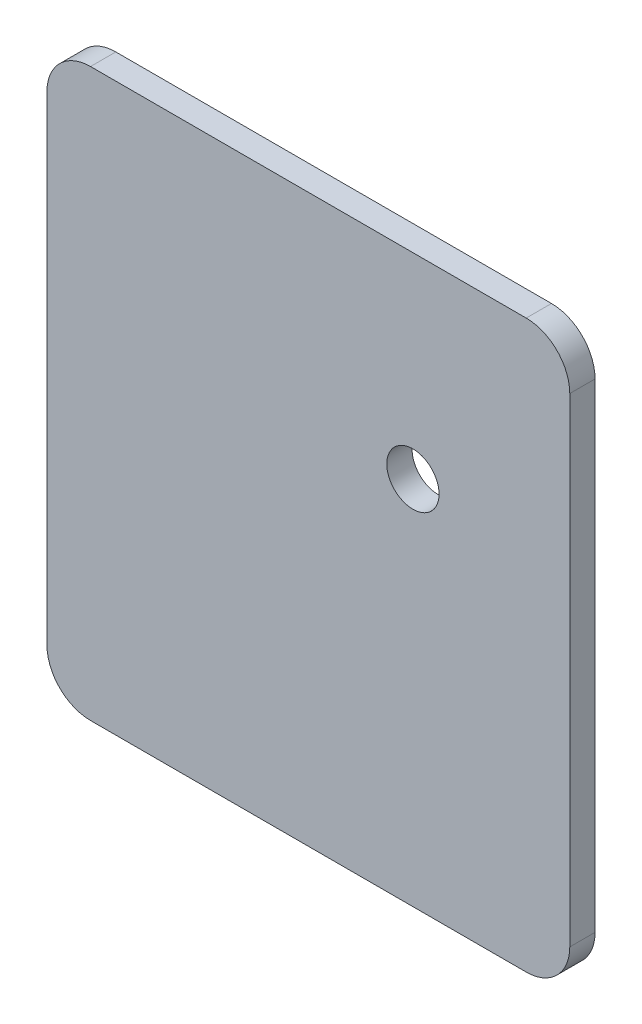
ISO-10303-21;
HEADER;
FILE_DESCRIPTION(('STEP AP214'),'2;1');
FILE_NAME('part.step','',(''),(''),'','','');
FILE_SCHEMA(('AUTOMOTIVE_DESIGN { 1 0 10303 214 1 1 1 1 }'));
ENDSEC;
DATA;
#1=APPLICATION_CONTEXT('core data for automotive mechanical design processes');
#2=APPLICATION_PROTOCOL_DEFINITION('international standard','automotive_design',2000,#1);
#3=PRODUCT_CONTEXT('',#1,'mechanical');
#4=PRODUCT('Part','Part','',(#3));
#5=PRODUCT_RELATED_PRODUCT_CATEGORY('part','',(#4));
#6=PRODUCT_DEFINITION_FORMATION('','',#4);
#7=PRODUCT_DEFINITION_CONTEXT('part definition',#1,'design');
#8=PRODUCT_DEFINITION('design','',#6,#7);
#9=PRODUCT_DEFINITION_SHAPE('','',#8);
#10=(LENGTH_UNIT() NAMED_UNIT(*) SI_UNIT(.MILLI.,.METRE.));
#11=(NAMED_UNIT(*) PLANE_ANGLE_UNIT() SI_UNIT($,.RADIAN.));
#12=(NAMED_UNIT(*) SI_UNIT($,.STERADIAN.) SOLID_ANGLE_UNIT());
#13=UNCERTAINTY_MEASURE_WITH_UNIT(LENGTH_MEASURE(1.E-05),#10,'distance_accuracy_value','');
#14=(GEOMETRIC_REPRESENTATION_CONTEXT(3) GLOBAL_UNCERTAINTY_ASSIGNED_CONTEXT((#13)) GLOBAL_UNIT_ASSIGNED_CONTEXT((#10,
#11,#12)) REPRESENTATION_CONTEXT('',''));
#15=CARTESIAN_POINT('',(0.,0.,0.));
#16=DIRECTION('',(0.,0.,1.));
#17=DIRECTION('',(1.,0.,0.));
#18=AXIS2_PLACEMENT_3D('',#15,#16,#17);
#19=CARTESIAN_POINT('',(0.,0.,-2.9));
#20=DIRECTION('',(0.,-1.,0.));
#21=DIRECTION('',(0.,0.,-1.));
#22=AXIS2_PLACEMENT_3D('',#19,#20,#21);
#23=PLANE('',#22);
#24=DIRECTION('',(1.,0.,0.));
#25=VECTOR('',#24,1.);
#26=CARTESIAN_POINT('',(0.,0.,0.));
#27=LINE('',#26,#25);
#28=CARTESIAN_POINT('',(5.,0.,0.));
#29=VERTEX_POINT('',#28);
#30=CARTESIAN_POINT('',(55.,0.,0.));
#31=VERTEX_POINT('',#30);
#32=EDGE_CURVE('E199',#29,#31,#27,.T.);
#33=ORIENTED_EDGE('',*,*,#32,.F.);
#34=DIRECTION('',(0.,0.,1.));
#35=VECTOR('',#34,1.);
#36=CARTESIAN_POINT('',(5.,0.,-2.9));
#37=LINE('',#36,#35);
#38=CARTESIAN_POINT('',(5.,0.,-2.9));
#39=VERTEX_POINT('',#38);
#40=EDGE_CURVE('E54',#29,#39,#37,.F.);
#41=ORIENTED_EDGE('',*,*,#40,.T.);
#42=DIRECTION('',(1.,0.,0.));
#43=VECTOR('',#42,1.);
#44=CARTESIAN_POINT('',(0.,0.,-2.9));
#45=LINE('',#44,#43);
#46=CARTESIAN_POINT('',(55.,0.,-2.9));
#47=VERTEX_POINT('',#46);
#48=EDGE_CURVE('E187',#39,#47,#45,.T.);
#49=ORIENTED_EDGE('',*,*,#48,.T.);
#50=DIRECTION('',(0.,0.,1.));
#51=VECTOR('',#50,1.);
#52=CARTESIAN_POINT('',(55.,0.,-2.9));
#53=LINE('',#52,#51);
#54=EDGE_CURVE('E160',#47,#31,#53,.T.);
#55=ORIENTED_EDGE('',*,*,#54,.T.);
#56=EDGE_LOOP('',(#33,#41,#49,#55));
#57=FACE_BOUND('',#56,.T.);
#58=ADVANCED_FACE('F45',(#57),#23,.T.);
#59=CARTESIAN_POINT('',(0.,0.,-2.9));
#60=DIRECTION('',(-1.,0.,0.));
#61=DIRECTION('',(0.,0.,1.));
#62=AXIS2_PLACEMENT_3D('',#59,#60,#61);
#63=PLANE('',#62);
#64=DIRECTION('',(0.,-1.,0.));
#65=VECTOR('',#64,1.);
#66=CARTESIAN_POINT('',(0.,0.,-2.9));
#67=LINE('',#66,#65);
#68=CARTESIAN_POINT('',(0.,60.,-2.9));
#69=VERTEX_POINT('',#68);
#70=CARTESIAN_POINT('',(0.,5.,-2.9));
#71=VERTEX_POINT('',#70);
#72=EDGE_CURVE('E135',#69,#71,#67,.T.);
#73=ORIENTED_EDGE('',*,*,#72,.T.);
#74=DIRECTION('',(0.,0.,1.));
#75=VECTOR('',#74,1.);
#76=CARTESIAN_POINT('',(0.,5.,-2.9));
#77=LINE('',#76,#75);
#78=CARTESIAN_POINT('',(0.,5.,0.));
#79=VERTEX_POINT('',#78);
#80=EDGE_CURVE('E174',#71,#79,#77,.T.);
#81=ORIENTED_EDGE('',*,*,#80,.T.);
#82=DIRECTION('',(0.,-1.,0.));
#83=VECTOR('',#82,1.);
#84=CARTESIAN_POINT('',(0.,0.,0.));
#85=LINE('',#84,#83);
#86=CARTESIAN_POINT('',(0.,60.,0.));
#87=VERTEX_POINT('',#86);
#88=EDGE_CURVE('E118',#87,#79,#85,.T.);
#89=ORIENTED_EDGE('',*,*,#88,.F.);
#90=DIRECTION('',(0.,0.,1.));
#91=VECTOR('',#90,1.);
#92=CARTESIAN_POINT('',(0.,60.,-2.9));
#93=LINE('',#92,#91);
#94=EDGE_CURVE('E127',#87,#69,#93,.F.);
#95=ORIENTED_EDGE('',*,*,#94,.T.);
#96=EDGE_LOOP('',(#73,#81,#89,#95));
#97=FACE_BOUND('',#96,.T.);
#98=ADVANCED_FACE('F182',(#97),#63,.T.);
#99=CARTESIAN_POINT('',(0.,65.,-2.9));
#100=DIRECTION('',(0.,1.,0.));
#101=DIRECTION('',(0.,0.,1.));
#102=AXIS2_PLACEMENT_3D('',#99,#100,#101);
#103=PLANE('',#102);
#104=DIRECTION('',(-1.,0.,0.));
#105=VECTOR('',#104,1.);
#106=CARTESIAN_POINT('',(0.,65.,0.));
#107=LINE('',#106,#105);
#108=CARTESIAN_POINT('',(55.,65.,0.));
#109=VERTEX_POINT('',#108);
#110=CARTESIAN_POINT('',(5.,65.,0.));
#111=VERTEX_POINT('',#110);
#112=EDGE_CURVE('E107',#109,#111,#107,.T.);
#113=ORIENTED_EDGE('',*,*,#112,.F.);
#114=DIRECTION('',(0.,0.,1.));
#115=VECTOR('',#114,1.);
#116=CARTESIAN_POINT('',(55.,65.,-2.9));
#117=LINE('',#116,#115);
#118=CARTESIAN_POINT('',(55.,65.,-2.9));
#119=VERTEX_POINT('',#118);
#120=EDGE_CURVE('E153',#109,#119,#117,.F.);
#121=ORIENTED_EDGE('',*,*,#120,.T.);
#122=DIRECTION('',(-1.,0.,0.));
#123=VECTOR('',#122,1.);
#124=CARTESIAN_POINT('',(0.,65.,-2.9));
#125=LINE('',#124,#123);
#126=CARTESIAN_POINT('',(5.,65.,-2.9));
#127=VERTEX_POINT('',#126);
#128=EDGE_CURVE('E132',#119,#127,#125,.T.);
#129=ORIENTED_EDGE('',*,*,#128,.T.);
#130=DIRECTION('',(0.,0.,1.));
#131=VECTOR('',#130,1.);
#132=CARTESIAN_POINT('',(5.,65.,-2.9));
#133=LINE('',#132,#131);
#134=EDGE_CURVE('E126',#127,#111,#133,.T.);
#135=ORIENTED_EDGE('',*,*,#134,.T.);
#136=EDGE_LOOP('',(#113,#121,#129,#135));
#137=FACE_BOUND('',#136,.T.);
#138=ADVANCED_FACE('F130',(#137),#103,.T.);
#139=CARTESIAN_POINT('',(60.,0.,-2.9));
#140=DIRECTION('',(1.,0.,0.));
#141=DIRECTION('',(0.,0.,-1.));
#142=AXIS2_PLACEMENT_3D('',#139,#140,#141);
#143=PLANE('',#142);
#144=DIRECTION('',(0.,1.,0.));
#145=VECTOR('',#144,1.);
#146=CARTESIAN_POINT('',(60.,0.,0.));
#147=LINE('',#146,#145);
#148=CARTESIAN_POINT('',(60.,5.,0.));
#149=VERTEX_POINT('',#148);
#150=CARTESIAN_POINT('',(60.,60.,0.));
#151=VERTEX_POINT('',#150);
#152=EDGE_CURVE('E119',#149,#151,#147,.T.);
#153=ORIENTED_EDGE('',*,*,#152,.F.);
#154=DIRECTION('',(0.,0.,1.));
#155=VECTOR('',#154,1.);
#156=CARTESIAN_POINT('',(60.,5.,-2.9));
#157=LINE('',#156,#155);
#158=CARTESIAN_POINT('',(60.,5.,-2.9));
#159=VERTEX_POINT('',#158);
#160=EDGE_CURVE('E167',#149,#159,#157,.F.);
#161=ORIENTED_EDGE('',*,*,#160,.T.);
#162=DIRECTION('',(0.,1.,0.));
#163=VECTOR('',#162,1.);
#164=CARTESIAN_POINT('',(60.,0.,-2.9));
#165=LINE('',#164,#163);
#166=CARTESIAN_POINT('',(60.,60.,-2.9));
#167=VERTEX_POINT('',#166);
#168=EDGE_CURVE('E189',#159,#167,#165,.T.);
#169=ORIENTED_EDGE('',*,*,#168,.T.);
#170=DIRECTION('',(0.,0.,1.));
#171=VECTOR('',#170,1.);
#172=CARTESIAN_POINT('',(60.,60.,-2.9));
#173=LINE('',#172,#171);
#174=EDGE_CURVE('E147',#167,#151,#173,.T.);
#175=ORIENTED_EDGE('',*,*,#174,.T.);
#176=EDGE_LOOP('',(#153,#161,#169,#175));
#177=FACE_BOUND('',#176,.T.);
#178=ADVANCED_FACE('F212',(#177),#143,.T.);
#179=CARTESIAN_POINT('',(0.,0.,-2.9));
#180=DIRECTION('',(0.,0.,1.));
#181=DIRECTION('',(1.,0.,0.));
#182=AXIS2_PLACEMENT_3D('',#179,#180,#181);
#183=PLANE('',#182);
#184=CARTESIAN_POINT('',(42.,42.5,-2.9));
#185=DIRECTION('',(0.,0.,1.));
#186=DIRECTION('',(1.,0.,0.));
#187=AXIS2_PLACEMENT_3D('',#184,#185,#186);
#188=CIRCLE('',#187,3.);
#189=CARTESIAN_POINT('',(45.,42.5,-2.9));
#190=VERTEX_POINT('',#189);
#191=EDGE_CURVE('E202',#190,#190,#188,.T.);
#192=ORIENTED_EDGE('',*,*,#191,.T.);
#193=EDGE_LOOP('',(#192));
#194=FACE_BOUND('',#193,.T.);
#195=ORIENTED_EDGE('',*,*,#48,.F.);
#196=CARTESIAN_POINT('',(5.,5.,-2.9));
#197=DIRECTION('',(0.,0.,1.));
#198=DIRECTION('',(1.,0.,0.));
#199=AXIS2_PLACEMENT_3D('',#196,#197,#198);
#200=CIRCLE('',#199,5.);
#201=EDGE_CURVE('E11',#39,#71,#200,.F.);
#202=ORIENTED_EDGE('',*,*,#201,.T.);
#203=ORIENTED_EDGE('',*,*,#72,.F.);
#204=CARTESIAN_POINT('',(5.,60.,-2.9));
#205=DIRECTION('',(0.,0.,1.));
#206=DIRECTION('',(1.,0.,0.));
#207=AXIS2_PLACEMENT_3D('',#204,#205,#206);
#208=CIRCLE('',#207,5.);
#209=EDGE_CURVE('E144',#69,#127,#208,.F.);
#210=ORIENTED_EDGE('',*,*,#209,.T.);
#211=ORIENTED_EDGE('',*,*,#128,.F.);
#212=CARTESIAN_POINT('',(55.,60.,-2.9));
#213=DIRECTION('',(0.,0.,1.));
#214=DIRECTION('',(1.,0.,0.));
#215=AXIS2_PLACEMENT_3D('',#212,#213,#214);
#216=CIRCLE('',#215,5.);
#217=EDGE_CURVE('E156',#119,#167,#216,.F.);
#218=ORIENTED_EDGE('',*,*,#217,.T.);
#219=ORIENTED_EDGE('',*,*,#168,.F.);
#220=CARTESIAN_POINT('',(55.,5.,-2.9));
#221=DIRECTION('',(0.,0.,1.));
#222=DIRECTION('',(1.,0.,0.));
#223=AXIS2_PLACEMENT_3D('',#220,#221,#222);
#224=CIRCLE('',#223,5.);
#225=EDGE_CURVE('E170',#159,#47,#224,.F.);
#226=ORIENTED_EDGE('',*,*,#225,.T.);
#227=EDGE_LOOP('',(#195,#202,#203,#210,#211,#218,#219,#226));
#228=FACE_BOUND('',#227,.T.);
#229=ADVANCED_FACE('F216',(#194,#228),#183,.F.);
#230=CARTESIAN_POINT('',(0.,0.,0.));
#231=DIRECTION('',(0.,0.,1.));
#232=DIRECTION('',(1.,0.,0.));
#233=AXIS2_PLACEMENT_3D('',#230,#231,#232);
#234=PLANE('',#233);
#235=CARTESIAN_POINT('',(42.,42.5,0.));
#236=DIRECTION('',(0.,0.,1.));
#237=DIRECTION('',(1.,0.,0.));
#238=AXIS2_PLACEMENT_3D('',#235,#236,#237);
#239=CIRCLE('',#238,3.);
#240=CARTESIAN_POINT('',(45.,42.5,0.));
#241=VERTEX_POINT('',#240);
#242=EDGE_CURVE('E194',#241,#241,#239,.T.);
#243=ORIENTED_EDGE('',*,*,#242,.F.);
#244=EDGE_LOOP('',(#243));
#245=FACE_BOUND('',#244,.T.);
#246=ORIENTED_EDGE('',*,*,#88,.T.);
#247=CARTESIAN_POINT('',(5.,5.,0.));
#248=DIRECTION('',(0.,0.,1.));
#249=DIRECTION('',(1.,0.,0.));
#250=AXIS2_PLACEMENT_3D('',#247,#248,#249);
#251=CIRCLE('',#250,5.);
#252=EDGE_CURVE('E68',#79,#29,#251,.T.);
#253=ORIENTED_EDGE('',*,*,#252,.T.);
#254=ORIENTED_EDGE('',*,*,#32,.T.);
#255=CARTESIAN_POINT('',(55.,5.,0.));
#256=DIRECTION('',(0.,0.,1.));
#257=DIRECTION('',(1.,0.,0.));
#258=AXIS2_PLACEMENT_3D('',#255,#256,#257);
#259=CIRCLE('',#258,5.);
#260=EDGE_CURVE('E164',#31,#149,#259,.T.);
#261=ORIENTED_EDGE('',*,*,#260,.T.);
#262=ORIENTED_EDGE('',*,*,#152,.T.);
#263=CARTESIAN_POINT('',(55.,60.,0.));
#264=DIRECTION('',(0.,0.,1.));
#265=DIRECTION('',(1.,0.,0.));
#266=AXIS2_PLACEMENT_3D('',#263,#264,#265);
#267=CIRCLE('',#266,5.);
#268=EDGE_CURVE('E113',#151,#109,#267,.T.);
#269=ORIENTED_EDGE('',*,*,#268,.T.);
#270=ORIENTED_EDGE('',*,*,#112,.T.);
#271=CARTESIAN_POINT('',(5.,60.,0.));
#272=DIRECTION('',(0.,0.,1.));
#273=DIRECTION('',(1.,0.,0.));
#274=AXIS2_PLACEMENT_3D('',#271,#272,#273);
#275=CIRCLE('',#274,5.);
#276=EDGE_CURVE('E110',#111,#87,#275,.T.);
#277=ORIENTED_EDGE('',*,*,#276,.T.);
#278=EDGE_LOOP('',(#246,#253,#254,#261,#262,#269,#270,#277));
#279=FACE_BOUND('',#278,.T.);
#280=ADVANCED_FACE('F109',(#245,#279),#234,.T.);
#281=CARTESIAN_POINT('',(42.,42.5,-2.9));
#282=DIRECTION('',(0.,0.,1.));
#283=DIRECTION('',(1.,0.,0.));
#284=AXIS2_PLACEMENT_3D('',#281,#282,#283);
#285=CYLINDRICAL_SURFACE('',#284,3.);
#286=ORIENTED_EDGE('',*,*,#191,.F.);
#287=EDGE_LOOP('',(#286));
#288=FACE_BOUND('',#287,.T.);
#289=ORIENTED_EDGE('',*,*,#242,.T.);
#290=EDGE_LOOP('',(#289));
#291=FACE_BOUND('',#290,.T.);
#292=ADVANCED_FACE('F235',(#288,#291),#285,.F.);
#293=CARTESIAN_POINT('',(5.,60.,-2.9));
#294=DIRECTION('',(0.,0.,1.));
#295=DIRECTION('',(1.,0.,0.));
#296=AXIS2_PLACEMENT_3D('',#293,#294,#295);
#297=CYLINDRICAL_SURFACE('',#296,5.);
#298=ORIENTED_EDGE('',*,*,#209,.F.);
#299=ORIENTED_EDGE('',*,*,#94,.F.);
#300=ORIENTED_EDGE('',*,*,#276,.F.);
#301=ORIENTED_EDGE('',*,*,#134,.F.);
#302=EDGE_LOOP('',(#298,#299,#300,#301));
#303=FACE_BOUND('',#302,.T.);
#304=ADVANCED_FACE('F125',(#303),#297,.T.);
#305=CARTESIAN_POINT('',(55.,60.,-2.9));
#306=DIRECTION('',(0.,0.,1.));
#307=DIRECTION('',(1.,0.,0.));
#308=AXIS2_PLACEMENT_3D('',#305,#306,#307);
#309=CYLINDRICAL_SURFACE('',#308,5.);
#310=ORIENTED_EDGE('',*,*,#217,.F.);
#311=ORIENTED_EDGE('',*,*,#120,.F.);
#312=ORIENTED_EDGE('',*,*,#268,.F.);
#313=ORIENTED_EDGE('',*,*,#174,.F.);
#314=EDGE_LOOP('',(#310,#311,#312,#313));
#315=FACE_BOUND('',#314,.T.);
#316=ADVANCED_FACE('F211',(#315),#309,.T.);
#317=CARTESIAN_POINT('',(55.,5.,-2.9));
#318=DIRECTION('',(0.,0.,1.));
#319=DIRECTION('',(1.,0.,0.));
#320=AXIS2_PLACEMENT_3D('',#317,#318,#319);
#321=CYLINDRICAL_SURFACE('',#320,5.);
#322=ORIENTED_EDGE('',*,*,#225,.F.);
#323=ORIENTED_EDGE('',*,*,#160,.F.);
#324=ORIENTED_EDGE('',*,*,#260,.F.);
#325=ORIENTED_EDGE('',*,*,#54,.F.);
#326=EDGE_LOOP('',(#322,#323,#324,#325));
#327=FACE_BOUND('',#326,.T.);
#328=ADVANCED_FACE('F218',(#327),#321,.T.);
#329=CARTESIAN_POINT('',(5.,5.,-2.9));
#330=DIRECTION('',(0.,0.,1.));
#331=DIRECTION('',(1.,0.,0.));
#332=AXIS2_PLACEMENT_3D('',#329,#330,#331);
#333=CYLINDRICAL_SURFACE('',#332,5.);
#334=ORIENTED_EDGE('',*,*,#201,.F.);
#335=ORIENTED_EDGE('',*,*,#40,.F.);
#336=ORIENTED_EDGE('',*,*,#252,.F.);
#337=ORIENTED_EDGE('',*,*,#80,.F.);
#338=EDGE_LOOP('',(#334,#335,#336,#337));
#339=FACE_BOUND('',#338,.T.);
#340=ADVANCED_FACE('F47',(#339),#333,.T.);
#341=CLOSED_SHELL('',(#58,#98,#138,#178,#229,#280,#292,#304,#316,#328,#340));
#342=MANIFOLD_SOLID_BREP('B2',#341);
#343=ADVANCED_BREP_SHAPE_REPRESENTATION('',(#18,#342),#14);
#344=SHAPE_DEFINITION_REPRESENTATION(#9,#343);
ENDSEC;
END-ISO-10303-21;
